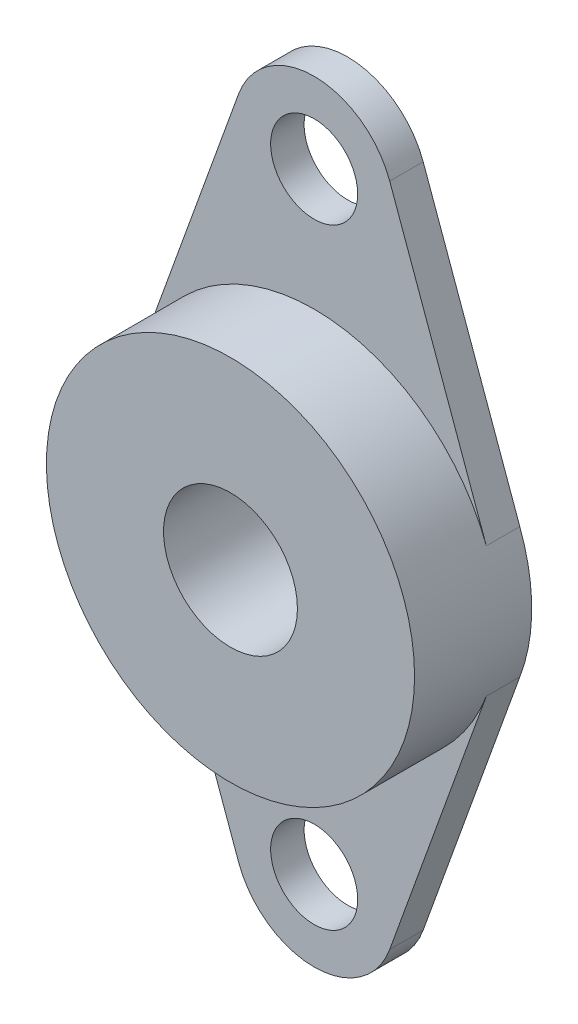
ISO-10303-21;
HEADER;
FILE_DESCRIPTION(('STEP AP214'),'2;1');
FILE_NAME('part.step','',(''),(''),'','','');
FILE_SCHEMA(('AUTOMOTIVE_DESIGN { 1 0 10303 214 1 1 1 1 }'));
ENDSEC;
DATA;
#1=APPLICATION_CONTEXT('core data for automotive mechanical design processes');
#2=APPLICATION_PROTOCOL_DEFINITION('international standard','automotive_design',2000,#1);
#3=PRODUCT_CONTEXT('',#1,'mechanical');
#4=PRODUCT('Part','Part','',(#3));
#5=PRODUCT_RELATED_PRODUCT_CATEGORY('part','',(#4));
#6=PRODUCT_DEFINITION_FORMATION('','',#4);
#7=PRODUCT_DEFINITION_CONTEXT('part definition',#1,'design');
#8=PRODUCT_DEFINITION('design','',#6,#7);
#9=PRODUCT_DEFINITION_SHAPE('','',#8);
#10=(LENGTH_UNIT() NAMED_UNIT(*) SI_UNIT(.MILLI.,.METRE.));
#11=(NAMED_UNIT(*) PLANE_ANGLE_UNIT() SI_UNIT($,.RADIAN.));
#12=(NAMED_UNIT(*) SI_UNIT($,.STERADIAN.) SOLID_ANGLE_UNIT());
#13=UNCERTAINTY_MEASURE_WITH_UNIT(LENGTH_MEASURE(1.E-05),#10,'distance_accuracy_value','');
#14=(GEOMETRIC_REPRESENTATION_CONTEXT(3) GLOBAL_UNCERTAINTY_ASSIGNED_CONTEXT((#13)) GLOBAL_UNIT_ASSIGNED_CONTEXT((#10,
#11,#12)) REPRESENTATION_CONTEXT('',''));
#15=CARTESIAN_POINT('',(0.,0.,0.));
#16=DIRECTION('',(0.,0.,1.));
#17=DIRECTION('',(1.,0.,0.));
#18=AXIS2_PLACEMENT_3D('',#15,#16,#17);
#19=CARTESIAN_POINT('',(0.,0.,7.));
#20=DIRECTION('',(0.,0.,1.));
#21=DIRECTION('',(1.,0.,0.));
#22=AXIS2_PLACEMENT_3D('',#19,#20,#21);
#23=PLANE('',#22);
#24=CARTESIAN_POINT('',(0.,0.,7.));
#25=DIRECTION('',(0.,0.,1.));
#26=DIRECTION('',(1.,0.,0.));
#27=AXIS2_PLACEMENT_3D('',#24,#25,#26);
#28=CIRCLE('',#27,4.);
#29=CARTESIAN_POINT('',(4.,0.,7.));
#30=VERTEX_POINT('',#29);
#31=EDGE_CURVE('E198',#30,#30,#28,.T.);
#32=ORIENTED_EDGE('',*,*,#31,.F.);
#33=EDGE_LOOP('',(#32));
#34=FACE_BOUND('',#33,.T.);
#35=CARTESIAN_POINT('',(0.,0.,7.));
#36=DIRECTION('',(0.,0.,1.));
#37=DIRECTION('',(1.,0.,0.));
#38=AXIS2_PLACEMENT_3D('',#35,#36,#37);
#39=CIRCLE('',#38,11.);
#40=CARTESIAN_POINT('',(11.,0.,7.));
#41=VERTEX_POINT('',#40);
#42=EDGE_CURVE('E186',#41,#41,#39,.T.);
#43=ORIENTED_EDGE('',*,*,#42,.T.);
#44=EDGE_LOOP('',(#43));
#45=FACE_BOUND('',#44,.T.);
#46=ADVANCED_FACE('F39',(#34,#45),#23,.T.);
#47=CARTESIAN_POINT('',(-4.51463490773956,-19.8803593621712,7.));
#48=DIRECTION('',(0.940548939112409,0.339658200452339,0.));
#49=DIRECTION('',(-0.339658200452339,0.940548939112409,0.));
#50=AXIS2_PLACEMENT_3D('',#47,#48,#49);
#51=PLANE('',#50);
#52=DIRECTION('',(0.339658200452339,-0.940548939112409,0.));
#53=VECTOR('',#52,1.);
#54=CARTESIAN_POINT('',(-10.3448740794966,-3.73581976187625,2.));
#55=LINE('',#54,#53);
#56=CARTESIAN_POINT('',(-10.2888243154293,-3.89102739726029,2.));
#57=VERTEX_POINT('',#56);
#58=CARTESIAN_POINT('',(-4.51463490773956,-19.8803593621712,2.));
#59=VERTEX_POINT('',#58);
#60=EDGE_CURVE('E226',#57,#59,#55,.T.);
#61=ORIENTED_EDGE('',*,*,#60,.F.);
#62=DIRECTION('',(0.,0.,-1.));
#63=VECTOR('',#62,1.);
#64=CARTESIAN_POINT('',(-10.2888243154293,-3.89102739726029,7.));
#65=LINE('',#64,#63);
#66=CARTESIAN_POINT('',(-10.2888243154293,-3.89102739726029,0.));
#67=VERTEX_POINT('',#66);
#68=EDGE_CURVE('E11',#57,#67,#65,.T.);
#69=ORIENTED_EDGE('',*,*,#68,.T.);
#70=DIRECTION('',(0.339658200452339,-0.940548939112409,0.));
#71=VECTOR('',#70,1.);
#72=CARTESIAN_POINT('',(-4.51463490773956,-19.8803593621712,0.));
#73=LINE('',#72,#71);
#74=CARTESIAN_POINT('',(-4.51463490773956,-19.8803593621712,0.));
#75=VERTEX_POINT('',#74);
#76=EDGE_CURVE('E156',#67,#75,#73,.T.);
#77=ORIENTED_EDGE('',*,*,#76,.T.);
#78=DIRECTION('',(0.,0.,-1.));
#79=VECTOR('',#78,1.);
#80=CARTESIAN_POINT('',(-4.51463490773956,-19.8803593621712,7.));
#81=LINE('',#80,#79);
#82=EDGE_CURVE('E48',#59,#75,#81,.T.);
#83=ORIENTED_EDGE('',*,*,#82,.F.);
#84=EDGE_LOOP('',(#61,#69,#77,#83));
#85=FACE_BOUND('',#84,.T.);
#86=ADVANCED_FACE('F41',(#85),#51,.F.);
#87=CARTESIAN_POINT('',(0.,-18.25,7.));
#88=DIRECTION('',(0.,0.,-1.));
#89=DIRECTION('',(-1.,0.,0.));
#90=AXIS2_PLACEMENT_3D('',#87,#88,#89);
#91=CYLINDRICAL_SURFACE('',#90,4.8);
#92=CARTESIAN_POINT('',(0.,-18.25,2.));
#93=DIRECTION('',(0.,0.,1.));
#94=DIRECTION('',(1.,0.,0.));
#95=AXIS2_PLACEMENT_3D('',#92,#93,#94);
#96=CIRCLE('',#95,4.8);
#97=CARTESIAN_POINT('',(4.51463490773956,-19.8803593621713,2.));
#98=VERTEX_POINT('',#97);
#99=EDGE_CURVE('E152',#59,#98,#96,.T.);
#100=ORIENTED_EDGE('',*,*,#99,.F.);
#101=ORIENTED_EDGE('',*,*,#82,.T.);
#102=CARTESIAN_POINT('',(0.,-18.25,0.));
#103=DIRECTION('',(0.,0.,1.));
#104=DIRECTION('',(-1.,0.,0.));
#105=AXIS2_PLACEMENT_3D('',#102,#103,#104);
#106=CIRCLE('',#105,4.8);
#107=CARTESIAN_POINT('',(4.51463490773956,-19.8803593621712,0.));
#108=VERTEX_POINT('',#107);
#109=EDGE_CURVE('E150',#75,#108,#106,.T.);
#110=ORIENTED_EDGE('',*,*,#109,.T.);
#111=DIRECTION('',(0.,0.,-1.));
#112=VECTOR('',#111,1.);
#113=CARTESIAN_POINT('',(4.51463490773956,-19.8803593621712,7.));
#114=LINE('',#113,#112);
#115=EDGE_CURVE('E134',#98,#108,#114,.T.);
#116=ORIENTED_EDGE('',*,*,#115,.F.);
#117=EDGE_LOOP('',(#100,#101,#110,#116));
#118=FACE_BOUND('',#117,.T.);
#119=ADVANCED_FACE('F147',(#118),#91,.T.);
#120=CARTESIAN_POINT('',(10.2888243154293,-3.89102739726029,7.));
#121=DIRECTION('',(-0.940548939112409,0.339658200452339,0.));
#122=DIRECTION('',(-0.339658200452339,-0.940548939112409,0.));
#123=AXIS2_PLACEMENT_3D('',#120,#121,#122);
#124=PLANE('',#123);
#125=DIRECTION('',(0.339658200452339,0.940548939112409,0.));
#126=VECTOR('',#125,1.);
#127=CARTESIAN_POINT('',(10.3448740794966,-3.73581976187625,2.));
#128=LINE('',#127,#126);
#129=CARTESIAN_POINT('',(10.2888243154293,-3.89102739726029,2.));
#130=VERTEX_POINT('',#129);
#131=EDGE_CURVE('E55',#98,#130,#128,.T.);
#132=ORIENTED_EDGE('',*,*,#131,.F.);
#133=ORIENTED_EDGE('',*,*,#115,.T.);
#134=DIRECTION('',(0.339658200452339,0.940548939112409,0.));
#135=VECTOR('',#134,1.);
#136=CARTESIAN_POINT('',(10.2888243154293,-3.89102739726029,0.));
#137=LINE('',#136,#135);
#138=CARTESIAN_POINT('',(10.2888243154293,-3.89102739726029,0.));
#139=VERTEX_POINT('',#138);
#140=EDGE_CURVE('E166',#108,#139,#137,.T.);
#141=ORIENTED_EDGE('',*,*,#140,.T.);
#142=DIRECTION('',(0.,0.,-1.));
#143=VECTOR('',#142,1.);
#144=CARTESIAN_POINT('',(10.2888243154293,-3.89102739726029,7.));
#145=LINE('',#144,#143);
#146=EDGE_CURVE('E130',#130,#139,#145,.T.);
#147=ORIENTED_EDGE('',*,*,#146,.F.);
#148=EDGE_LOOP('',(#132,#133,#141,#147));
#149=FACE_BOUND('',#148,.T.);
#150=ADVANCED_FACE('F271',(#149),#124,.F.);
#151=CARTESIAN_POINT('',(4.51463490773956,19.8803593621712,7.));
#152=DIRECTION('',(-0.940548939112409,-0.339658200452339,0.));
#153=DIRECTION('',(0.33965820045234,-0.940548939112409,0.));
#154=AXIS2_PLACEMENT_3D('',#151,#152,#153);
#155=PLANE('',#154);
#156=DIRECTION('',(-0.339658200452339,0.940548939112409,0.));
#157=VECTOR('',#156,1.);
#158=CARTESIAN_POINT('',(10.3448740794966,3.73581976187625,2.));
#159=LINE('',#158,#157);
#160=CARTESIAN_POINT('',(10.2888243154293,3.8910273972603,2.));
#161=VERTEX_POINT('',#160);
#162=CARTESIAN_POINT('',(4.51463490773955,19.8803593621712,2.));
#163=VERTEX_POINT('',#162);
#164=EDGE_CURVE('E106',#161,#163,#159,.T.);
#165=ORIENTED_EDGE('',*,*,#164,.F.);
#166=DIRECTION('',(0.,0.,-1.));
#167=VECTOR('',#166,1.);
#168=CARTESIAN_POINT('',(10.2888243154293,3.89102739726029,7.));
#169=LINE('',#168,#167);
#170=CARTESIAN_POINT('',(10.2888243154293,3.89102739726029,0.));
#171=VERTEX_POINT('',#170);
#172=EDGE_CURVE('E118',#161,#171,#169,.T.);
#173=ORIENTED_EDGE('',*,*,#172,.T.);
#174=DIRECTION('',(-0.339658200452339,0.940548939112409,0.));
#175=VECTOR('',#174,1.);
#176=CARTESIAN_POINT('',(4.51463490773956,19.8803593621712,0.));
#177=LINE('',#176,#175);
#178=CARTESIAN_POINT('',(4.51463490773956,19.8803593621712,0.));
#179=VERTEX_POINT('',#178);
#180=EDGE_CURVE('E175',#171,#179,#177,.T.);
#181=ORIENTED_EDGE('',*,*,#180,.T.);
#182=DIRECTION('',(0.,0.,-1.));
#183=VECTOR('',#182,1.);
#184=CARTESIAN_POINT('',(4.51463490773956,19.8803593621712,7.));
#185=LINE('',#184,#183);
#186=EDGE_CURVE('E120',#163,#179,#185,.T.);
#187=ORIENTED_EDGE('',*,*,#186,.F.);
#188=EDGE_LOOP('',(#165,#173,#181,#187));
#189=FACE_BOUND('',#188,.T.);
#190=ADVANCED_FACE('F116',(#189),#155,.F.);
#191=CARTESIAN_POINT('',(0.,18.25,7.));
#192=DIRECTION('',(0.,0.,-1.));
#193=DIRECTION('',(-1.,0.,0.));
#194=AXIS2_PLACEMENT_3D('',#191,#192,#193);
#195=CYLINDRICAL_SURFACE('',#194,4.8);
#196=CARTESIAN_POINT('',(0.,18.25,2.));
#197=DIRECTION('',(0.,0.,1.));
#198=DIRECTION('',(1.,0.,0.));
#199=AXIS2_PLACEMENT_3D('',#196,#197,#198);
#200=CIRCLE('',#199,4.8);
#201=CARTESIAN_POINT('',(-4.51463490773957,19.8803593621712,2.));
#202=VERTEX_POINT('',#201);
#203=EDGE_CURVE('E63',#163,#202,#200,.T.);
#204=ORIENTED_EDGE('',*,*,#203,.F.);
#205=ORIENTED_EDGE('',*,*,#186,.T.);
#206=CARTESIAN_POINT('',(0.,18.25,0.));
#207=DIRECTION('',(0.,0.,1.));
#208=DIRECTION('',(1.,0.,0.));
#209=AXIS2_PLACEMENT_3D('',#206,#207,#208);
#210=CIRCLE('',#209,4.8);
#211=CARTESIAN_POINT('',(-4.51463490773957,19.8803593621712,0.));
#212=VERTEX_POINT('',#211);
#213=EDGE_CURVE('E178',#179,#212,#210,.T.);
#214=ORIENTED_EDGE('',*,*,#213,.T.);
#215=DIRECTION('',(0.,0.,-1.));
#216=VECTOR('',#215,1.);
#217=CARTESIAN_POINT('',(-4.51463490773957,19.8803593621712,7.));
#218=LINE('',#217,#216);
#219=EDGE_CURVE('E136',#202,#212,#218,.T.);
#220=ORIENTED_EDGE('',*,*,#219,.F.);
#221=EDGE_LOOP('',(#204,#205,#214,#220));
#222=FACE_BOUND('',#221,.T.);
#223=ADVANCED_FACE('F196',(#222),#195,.T.);
#224=CARTESIAN_POINT('',(-4.51463490773956,19.8803593621712,7.));
#225=DIRECTION('',(0.940548939112409,-0.339658200452339,0.));
#226=DIRECTION('',(0.33965820045234,0.940548939112409,0.));
#227=AXIS2_PLACEMENT_3D('',#224,#225,#226);
#228=PLANE('',#227);
#229=DIRECTION('',(-0.339658200452339,-0.940548939112409,0.));
#230=VECTOR('',#229,1.);
#231=CARTESIAN_POINT('',(-10.3448740794966,3.73581976187625,2.));
#232=LINE('',#231,#230);
#233=CARTESIAN_POINT('',(-10.2888243154293,3.8910273972603,2.));
#234=VERTEX_POINT('',#233);
#235=EDGE_CURVE('E107',#202,#234,#232,.T.);
#236=ORIENTED_EDGE('',*,*,#235,.F.);
#237=ORIENTED_EDGE('',*,*,#219,.T.);
#238=DIRECTION('',(-0.339658200452339,-0.940548939112409,0.));
#239=VECTOR('',#238,1.);
#240=CARTESIAN_POINT('',(-4.51463490773956,19.8803593621712,0.));
#241=LINE('',#240,#239);
#242=CARTESIAN_POINT('',(-10.2888243154293,3.89102739726029,0.));
#243=VERTEX_POINT('',#242);
#244=EDGE_CURVE('E182',#212,#243,#241,.T.);
#245=ORIENTED_EDGE('',*,*,#244,.T.);
#246=DIRECTION('',(0.,0.,-1.));
#247=VECTOR('',#246,1.);
#248=CARTESIAN_POINT('',(-10.2888243154293,3.89102739726029,7.));
#249=LINE('',#248,#247);
#250=EDGE_CURVE('E187',#234,#243,#249,.T.);
#251=ORIENTED_EDGE('',*,*,#250,.F.);
#252=EDGE_LOOP('',(#236,#237,#245,#251));
#253=FACE_BOUND('',#252,.T.);
#254=ADVANCED_FACE('F192',(#253),#228,.F.);
#255=CARTESIAN_POINT('',(0.,-18.25,7.));
#256=DIRECTION('',(0.,0.,-1.));
#257=DIRECTION('',(-1.,0.,0.));
#258=AXIS2_PLACEMENT_3D('',#255,#256,#257);
#259=CYLINDRICAL_SURFACE('',#258,2.6);
#260=CARTESIAN_POINT('',(0.,-18.25,0.));
#261=DIRECTION('',(0.,0.,1.));
#262=DIRECTION('',(1.,0.,0.));
#263=AXIS2_PLACEMENT_3D('',#260,#261,#262);
#264=CIRCLE('',#263,2.6);
#265=CARTESIAN_POINT('',(2.6,-18.25,0.));
#266=VERTEX_POINT('',#265);
#267=EDGE_CURVE('E209',#266,#266,#264,.T.);
#268=ORIENTED_EDGE('',*,*,#267,.F.);
#269=EDGE_LOOP('',(#268));
#270=FACE_BOUND('',#269,.T.);
#271=CARTESIAN_POINT('',(0.,-18.25,2.));
#272=DIRECTION('',(0.,0.,1.));
#273=DIRECTION('',(1.,0.,0.));
#274=AXIS2_PLACEMENT_3D('',#271,#272,#273);
#275=CIRCLE('',#274,2.6);
#276=CARTESIAN_POINT('',(2.6,-18.25,2.));
#277=VERTEX_POINT('',#276);
#278=EDGE_CURVE('E112',#277,#277,#275,.F.);
#279=ORIENTED_EDGE('',*,*,#278,.F.);
#280=EDGE_LOOP('',(#279));
#281=FACE_BOUND('',#280,.T.);
#282=ADVANCED_FACE('F242',(#270,#281),#259,.F.);
#283=CARTESIAN_POINT('',(0.,18.25,7.));
#284=DIRECTION('',(0.,0.,-1.));
#285=DIRECTION('',(-1.,0.,0.));
#286=AXIS2_PLACEMENT_3D('',#283,#284,#285);
#287=CYLINDRICAL_SURFACE('',#286,2.6);
#288=CARTESIAN_POINT('',(0.,18.25,0.));
#289=DIRECTION('',(0.,0.,1.));
#290=DIRECTION('',(1.,0.,0.));
#291=AXIS2_PLACEMENT_3D('',#288,#289,#290);
#292=CIRCLE('',#291,2.6);
#293=CARTESIAN_POINT('',(2.59999999999999,18.25,0.));
#294=VERTEX_POINT('',#293);
#295=EDGE_CURVE('E214',#294,#294,#292,.T.);
#296=ORIENTED_EDGE('',*,*,#295,.F.);
#297=EDGE_LOOP('',(#296));
#298=FACE_BOUND('',#297,.T.);
#299=CARTESIAN_POINT('',(0.,18.25,2.));
#300=DIRECTION('',(0.,0.,1.));
#301=DIRECTION('',(1.,0.,0.));
#302=AXIS2_PLACEMENT_3D('',#299,#300,#301);
#303=CIRCLE('',#302,2.6);
#304=CARTESIAN_POINT('',(2.59999999999999,18.25,2.));
#305=VERTEX_POINT('',#304);
#306=EDGE_CURVE('E218',#305,#305,#303,.F.);
#307=ORIENTED_EDGE('',*,*,#306,.F.);
#308=EDGE_LOOP('',(#307));
#309=FACE_BOUND('',#308,.T.);
#310=ADVANCED_FACE('F240',(#298,#309),#287,.F.);
#311=CARTESIAN_POINT('',(0.,0.,0.));
#312=DIRECTION('',(0.,0.,1.));
#313=DIRECTION('',(1.,0.,0.));
#314=AXIS2_PLACEMENT_3D('',#311,#312,#313);
#315=PLANE('',#314);
#316=CARTESIAN_POINT('',(0.,0.,0.));
#317=DIRECTION('',(0.,0.,1.));
#318=DIRECTION('',(1.,0.,0.));
#319=AXIS2_PLACEMENT_3D('',#316,#317,#318);
#320=CIRCLE('',#319,11.);
#321=EDGE_CURVE('E161',#243,#67,#320,.T.);
#322=ORIENTED_EDGE('',*,*,#321,.F.);
#323=ORIENTED_EDGE('',*,*,#244,.F.);
#324=ORIENTED_EDGE('',*,*,#213,.F.);
#325=ORIENTED_EDGE('',*,*,#180,.F.);
#326=CARTESIAN_POINT('',(0.,0.,0.));
#327=DIRECTION('',(0.,0.,1.));
#328=DIRECTION('',(1.,0.,0.));
#329=AXIS2_PLACEMENT_3D('',#326,#327,#328);
#330=CIRCLE('',#329,11.);
#331=EDGE_CURVE('E127',#139,#171,#330,.T.);
#332=ORIENTED_EDGE('',*,*,#331,.F.);
#333=ORIENTED_EDGE('',*,*,#140,.F.);
#334=ORIENTED_EDGE('',*,*,#109,.F.);
#335=ORIENTED_EDGE('',*,*,#76,.F.);
#336=EDGE_LOOP('',(#322,#323,#324,#325,#332,#333,#334,#335));
#337=FACE_BOUND('',#336,.T.);
#338=CARTESIAN_POINT('',(0.,0.,0.));
#339=DIRECTION('',(0.,0.,1.));
#340=DIRECTION('',(1.,0.,0.));
#341=AXIS2_PLACEMENT_3D('',#338,#339,#340);
#342=CIRCLE('',#341,4.);
#343=CARTESIAN_POINT('',(4.,0.,0.));
#344=VERTEX_POINT('',#343);
#345=EDGE_CURVE('E201',#344,#344,#342,.T.);
#346=ORIENTED_EDGE('',*,*,#345,.T.);
#347=EDGE_LOOP('',(#346));
#348=FACE_BOUND('',#347,.T.);
#349=ORIENTED_EDGE('',*,*,#267,.T.);
#350=EDGE_LOOP('',(#349));
#351=FACE_BOUND('',#350,.T.);
#352=ORIENTED_EDGE('',*,*,#295,.T.);
#353=EDGE_LOOP('',(#352));
#354=FACE_BOUND('',#353,.T.);
#355=ADVANCED_FACE('F163',(#337,#348,#351,#354),#315,.F.);
#356=CARTESIAN_POINT('',(0.,0.,7.));
#357=DIRECTION('',(0.,0.,-1.));
#358=DIRECTION('',(-1.,0.,0.));
#359=AXIS2_PLACEMENT_3D('',#356,#357,#358);
#360=CYLINDRICAL_SURFACE('',#359,11.);
#361=ORIENTED_EDGE('',*,*,#68,.F.);
#362=CARTESIAN_POINT('',(0.,0.,2.));
#363=DIRECTION('',(0.,0.,1.));
#364=DIRECTION('',(1.,0.,0.));
#365=AXIS2_PLACEMENT_3D('',#362,#363,#364);
#366=CIRCLE('',#365,11.);
#367=EDGE_CURVE('E229',#57,#130,#366,.T.);
#368=ORIENTED_EDGE('',*,*,#367,.T.);
#369=ORIENTED_EDGE('',*,*,#146,.T.);
#370=ORIENTED_EDGE('',*,*,#331,.T.);
#371=ORIENTED_EDGE('',*,*,#172,.F.);
#372=CARTESIAN_POINT('',(0.,0.,2.));
#373=DIRECTION('',(0.,0.,1.));
#374=DIRECTION('',(1.,0.,0.));
#375=AXIS2_PLACEMENT_3D('',#372,#373,#374);
#376=CIRCLE('',#375,11.);
#377=EDGE_CURVE('E102',#161,#234,#376,.T.);
#378=ORIENTED_EDGE('',*,*,#377,.T.);
#379=ORIENTED_EDGE('',*,*,#250,.T.);
#380=ORIENTED_EDGE('',*,*,#321,.T.);
#381=EDGE_LOOP('',(#361,#368,#369,#370,#371,#378,#379,#380));
#382=FACE_BOUND('',#381,.T.);
#383=ORIENTED_EDGE('',*,*,#42,.F.);
#384=EDGE_LOOP('',(#383));
#385=FACE_BOUND('',#384,.T.);
#386=ADVANCED_FACE('F124',(#382,#385),#360,.T.);
#387=CARTESIAN_POINT('',(0.,0.,7.));
#388=DIRECTION('',(0.,0.,-1.));
#389=DIRECTION('',(-1.,0.,0.));
#390=AXIS2_PLACEMENT_3D('',#387,#388,#389);
#391=CYLINDRICAL_SURFACE('',#390,4.);
#392=ORIENTED_EDGE('',*,*,#31,.T.);
#393=EDGE_LOOP('',(#392));
#394=FACE_BOUND('',#393,.T.);
#395=ORIENTED_EDGE('',*,*,#345,.F.);
#396=EDGE_LOOP('',(#395));
#397=FACE_BOUND('',#396,.T.);
#398=ADVANCED_FACE('F263',(#394,#397),#391,.F.);
#399=CARTESIAN_POINT('',(0.,0.,2.));
#400=DIRECTION('',(0.,0.,1.));
#401=DIRECTION('',(1.,0.,0.));
#402=AXIS2_PLACEMENT_3D('',#399,#400,#401);
#403=PLANE('',#402);
#404=ORIENTED_EDGE('',*,*,#377,.F.);
#405=ORIENTED_EDGE('',*,*,#164,.T.);
#406=ORIENTED_EDGE('',*,*,#203,.T.);
#407=ORIENTED_EDGE('',*,*,#235,.T.);
#408=EDGE_LOOP('',(#404,#405,#406,#407));
#409=FACE_BOUND('',#408,.T.);
#410=ORIENTED_EDGE('',*,*,#306,.T.);
#411=EDGE_LOOP('',(#410));
#412=FACE_BOUND('',#411,.T.);
#413=ADVANCED_FACE('F104',(#409,#412),#403,.T.);
#414=CARTESIAN_POINT('',(0.,0.,2.));
#415=DIRECTION('',(0.,0.,1.));
#416=DIRECTION('',(1.,0.,0.));
#417=AXIS2_PLACEMENT_3D('',#414,#415,#416);
#418=PLANE('',#417);
#419=ORIENTED_EDGE('',*,*,#367,.F.);
#420=ORIENTED_EDGE('',*,*,#60,.T.);
#421=ORIENTED_EDGE('',*,*,#99,.T.);
#422=ORIENTED_EDGE('',*,*,#131,.T.);
#423=EDGE_LOOP('',(#419,#420,#421,#422));
#424=FACE_BOUND('',#423,.T.);
#425=ORIENTED_EDGE('',*,*,#278,.T.);
#426=EDGE_LOOP('',(#425));
#427=FACE_BOUND('',#426,.T.);
#428=ADVANCED_FACE('F323',(#424,#427),#418,.T.);
#429=CLOSED_SHELL('',(#46,#86,#119,#150,#190,#223,#254,#282,#310,#355,#386,#398,#413,#428));
#430=MANIFOLD_SOLID_BREP('B2',#429);
#431=ADVANCED_BREP_SHAPE_REPRESENTATION('',(#18,#430),#14);
#432=SHAPE_DEFINITION_REPRESENTATION(#9,#431);
ENDSEC;
END-ISO-10303-21;
